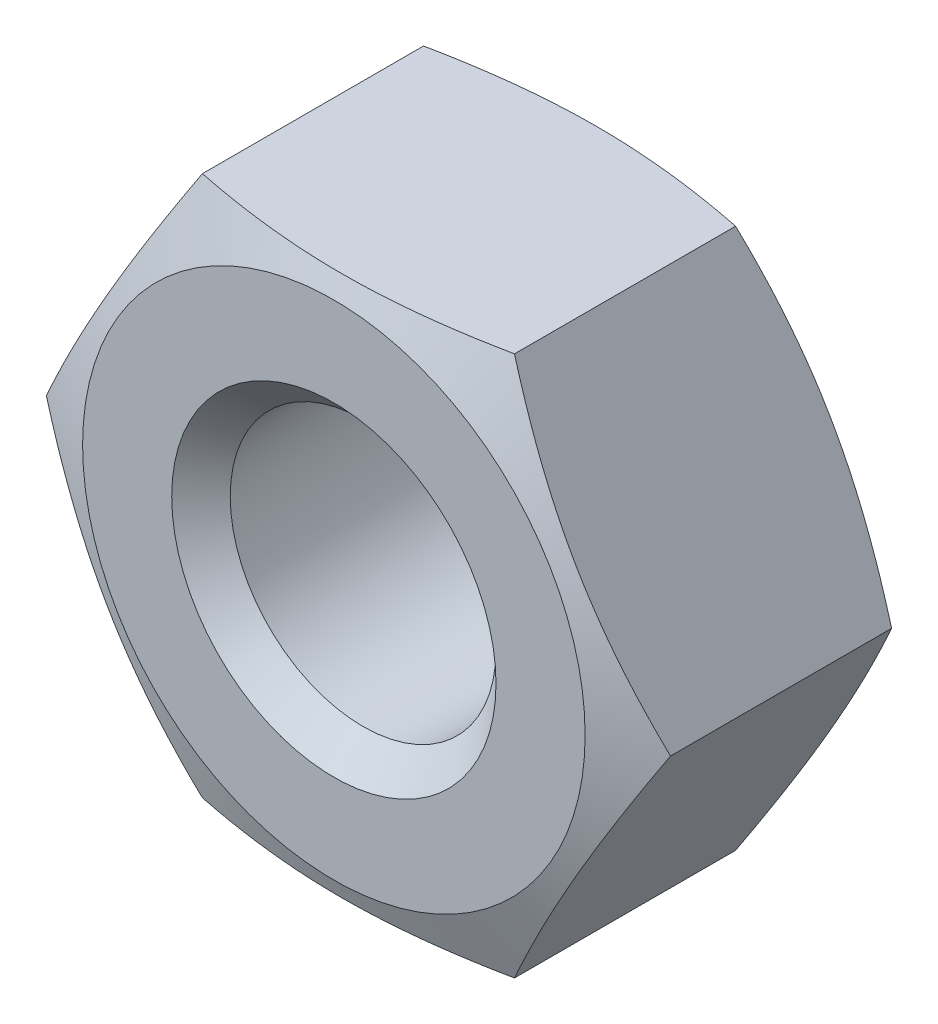
ISO-10303-21;
HEADER;
FILE_DESCRIPTION(('STEP AP214'),'2;1');
FILE_NAME('part.step','',(''),(''),'','','');
FILE_SCHEMA(('AUTOMOTIVE_DESIGN { 1 0 10303 214 1 1 1 1 }'));
ENDSEC;
DATA;
#1=APPLICATION_CONTEXT('core data for automotive mechanical design processes');
#2=APPLICATION_PROTOCOL_DEFINITION('international standard','automotive_design',2000,#1);
#3=PRODUCT_CONTEXT('',#1,'mechanical');
#4=PRODUCT('Part','Part','',(#3));
#5=PRODUCT_RELATED_PRODUCT_CATEGORY('part','',(#4));
#6=PRODUCT_DEFINITION_FORMATION('','',#4);
#7=PRODUCT_DEFINITION_CONTEXT('part definition',#1,'design');
#8=PRODUCT_DEFINITION('design','',#6,#7);
#9=PRODUCT_DEFINITION_SHAPE('','',#8);
#10=(LENGTH_UNIT() NAMED_UNIT(*) SI_UNIT(.MILLI.,.METRE.));
#11=(NAMED_UNIT(*) PLANE_ANGLE_UNIT() SI_UNIT($,.RADIAN.));
#12=(NAMED_UNIT(*) SI_UNIT($,.STERADIAN.) SOLID_ANGLE_UNIT());
#13=UNCERTAINTY_MEASURE_WITH_UNIT(LENGTH_MEASURE(1.E-05),#10,'distance_accuracy_value','');
#14=(GEOMETRIC_REPRESENTATION_CONTEXT(3) GLOBAL_UNCERTAINTY_ASSIGNED_CONTEXT((#13)) GLOBAL_UNIT_ASSIGNED_CONTEXT((#10,
#11,#12)) REPRESENTATION_CONTEXT('',''));
#15=CARTESIAN_POINT('',(0.,0.,0.));
#16=DIRECTION('',(0.,0.,1.));
#17=DIRECTION('',(1.,0.,0.));
#18=AXIS2_PLACEMENT_3D('',#15,#16,#17);
#19=CARTESIAN_POINT('',(-4.330125,-2.49999883437473,0.));
#20=DIRECTION('',(-0.866025403784439,-0.5,0.));
#21=DIRECTION('',(0.5,-0.866025403784439,0.));
#22=AXIS2_PLACEMENT_3D('',#19,#20,#21);
#23=PLANE('',#22);
#24=CARTESIAN_POINT('',(-5.7735,0.,4.54545454545455));
#25=CARTESIAN_POINT('',(-4.330125,-2.49999883437473,5.12861589916936));
#26=CARTESIAN_POINT('',(-2.88675,-4.99999766874946,4.54545454545455));
#27=(BOUNDED_CURVE() B_SPLINE_CURVE(2,(#24,#25,#26),.UNSPECIFIED.,.F.,
.F.) B_SPLINE_CURVE_WITH_KNOTS((3,3),(0.,5.80723387852188),
.UNSPECIFIED.) CURVE() GEOMETRIC_REPRESENTATION_ITEM() RATIONAL_B_SPLINE_CURVE((1.,
1.15470053837925,1.)) REPRESENTATION_ITEM(''));
#28=CARTESIAN_POINT('',(-5.7735,0.,4.54545454545455));
#29=VERTEX_POINT('',#28);
#30=CARTESIAN_POINT('',(-2.88675,-4.99999766874946,4.54545454545455));
#31=VERTEX_POINT('',#30);
#32=EDGE_CURVE('E107',#29,#31,#27,.T.);
#33=ORIENTED_EDGE('',*,*,#32,.F.);
#34=DIRECTION('',(0.,0.,1.));
#35=VECTOR('',#34,1.);
#36=CARTESIAN_POINT('',(-5.7735,0.,0.));
#37=LINE('',#36,#35);
#38=CARTESIAN_POINT('',(-5.7735,0.,0.454545454545455));
#39=VERTEX_POINT('',#38);
#40=EDGE_CURVE('E111',#39,#29,#37,.T.);
#41=ORIENTED_EDGE('',*,*,#40,.F.);
#42=CARTESIAN_POINT('',(-2.88675,-4.99999766874946,0.454545454545455));
#43=CARTESIAN_POINT('',(-4.330125,-2.49999883437473,-0.128615899169365));
#44=CARTESIAN_POINT('',(-5.7735,0.,0.454545454545455));
#45=(BOUNDED_CURVE() B_SPLINE_CURVE(2,(#42,#43,#44),.UNSPECIFIED.,.F.,
.F.) B_SPLINE_CURVE_WITH_KNOTS((3,3),(0.,5.80723387852187),
.UNSPECIFIED.) CURVE() GEOMETRIC_REPRESENTATION_ITEM() RATIONAL_B_SPLINE_CURVE((1.,
1.15470053837925,1.)) REPRESENTATION_ITEM(''));
#46=CARTESIAN_POINT('',(-2.88675,-4.99999766874946,0.454545454545455));
#47=VERTEX_POINT('',#46);
#48=EDGE_CURVE('E129',#47,#39,#45,.T.);
#49=ORIENTED_EDGE('',*,*,#48,.F.);
#50=DIRECTION('',(0.,0.,1.));
#51=VECTOR('',#50,1.);
#52=CARTESIAN_POINT('',(-2.88675,-4.99999766874946,0.));
#53=LINE('',#52,#51);
#54=EDGE_CURVE('E10',#47,#31,#53,.T.);
#55=ORIENTED_EDGE('',*,*,#54,.T.);
#56=EDGE_LOOP('',(#33,#41,#49,#55));
#57=FACE_BOUND('',#56,.T.);
#58=ADVANCED_FACE('F15',(#57),#23,.T.);
#59=CARTESIAN_POINT('',(0.,-4.99999766874946,0.));
#60=DIRECTION('',(0.,-1.,0.));
#61=DIRECTION('',(1.,0.,0.));
#62=AXIS2_PLACEMENT_3D('',#59,#60,#61);
#63=PLANE('',#62);
#64=CARTESIAN_POINT('',(-2.88675,-4.99999766874946,4.54545454545455));
#65=CARTESIAN_POINT('',(0.,-4.99999766874946,5.12861589916937));
#66=CARTESIAN_POINT('',(2.88675,-4.99999766874946,4.54545454545455));
#67=(BOUNDED_CURVE() B_SPLINE_CURVE(2,(#64,#65,#66),.UNSPECIFIED.,.F.,
.F.) B_SPLINE_CURVE_WITH_KNOTS((3,3),(0.,5.80723387852187),
.UNSPECIFIED.) CURVE() GEOMETRIC_REPRESENTATION_ITEM() RATIONAL_B_SPLINE_CURVE((1.,
1.15470053837925,1.)) REPRESENTATION_ITEM(''));
#68=CARTESIAN_POINT('',(2.88675,-4.99999766874946,4.54545454545455));
#69=VERTEX_POINT('',#68);
#70=EDGE_CURVE('E104',#31,#69,#67,.T.);
#71=ORIENTED_EDGE('',*,*,#70,.F.);
#72=ORIENTED_EDGE('',*,*,#54,.F.);
#73=CARTESIAN_POINT('',(2.88675,-4.99999766874946,0.454545454545455));
#74=CARTESIAN_POINT('',(0.,-4.99999766874946,-0.128615899169365));
#75=CARTESIAN_POINT('',(-2.88675,-4.99999766874946,0.454545454545455));
#76=(BOUNDED_CURVE() B_SPLINE_CURVE(2,(#73,#74,#75),.UNSPECIFIED.,.F.,
.F.) B_SPLINE_CURVE_WITH_KNOTS((3,3),(0.,5.80723387852187),
.UNSPECIFIED.) CURVE() GEOMETRIC_REPRESENTATION_ITEM() RATIONAL_B_SPLINE_CURVE((1.,
1.15470053837925,1.)) REPRESENTATION_ITEM(''));
#77=CARTESIAN_POINT('',(2.88675,-4.99999766874946,0.454545454545455));
#78=VERTEX_POINT('',#77);
#79=EDGE_CURVE('E147',#78,#47,#76,.T.);
#80=ORIENTED_EDGE('',*,*,#79,.F.);
#81=DIRECTION('',(0.,0.,1.));
#82=VECTOR('',#81,1.);
#83=CARTESIAN_POINT('',(2.88675,-4.99999766874946,0.));
#84=LINE('',#83,#82);
#85=EDGE_CURVE('E25',#78,#69,#84,.T.);
#86=ORIENTED_EDGE('',*,*,#85,.T.);
#87=EDGE_LOOP('',(#71,#72,#80,#86));
#88=FACE_BOUND('',#87,.T.);
#89=ADVANCED_FACE('F17',(#88),#63,.T.);
#90=CARTESIAN_POINT('',(0.,0.,0.));
#91=DIRECTION('',(0.,0.,1.));
#92=DIRECTION('',(1.,0.,0.));
#93=AXIS2_PLACEMENT_3D('',#90,#91,#92);
#94=PLANE('',#93);
#95=CARTESIAN_POINT('',(0.,0.,0.));
#96=DIRECTION('',(0.,0.,1.));
#97=DIRECTION('',(1.,0.,0.));
#98=AXIS2_PLACEMENT_3D('',#95,#96,#97);
#99=CIRCLE('',#98,4.64846052117441);
#100=CARTESIAN_POINT('',(4.64846052117441,0.,0.));
#101=VERTEX_POINT('',#100);
#102=EDGE_CURVE('E139',#101,#101,#99,.T.);
#103=ORIENTED_EDGE('',*,*,#102,.F.);
#104=EDGE_LOOP('',(#103));
#105=FACE_BOUND('',#104,.T.);
#106=CARTESIAN_POINT('',(0.,0.,0.));
#107=DIRECTION('',(0.,0.,-1.));
#108=DIRECTION('',(1.,0.,0.));
#109=AXIS2_PLACEMENT_3D('',#106,#107,#108);
#110=CIRCLE('',#109,3.);
#111=CARTESIAN_POINT('',(3.,0.,0.));
#112=VERTEX_POINT('',#111);
#113=EDGE_CURVE('E32',#112,#112,#110,.T.);
#114=ORIENTED_EDGE('',*,*,#113,.F.);
#115=EDGE_LOOP('',(#114));
#116=FACE_BOUND('',#115,.T.);
#117=ADVANCED_FACE('F235',(#105,#116),#94,.F.);
#118=CARTESIAN_POINT('',(0.,0.,5.));
#119=DIRECTION('',(0.,0.,1.));
#120=DIRECTION('',(1.,0.,0.));
#121=AXIS2_PLACEMENT_3D('',#118,#119,#120);
#122=PLANE('',#121);
#123=CARTESIAN_POINT('',(0.,0.,5.));
#124=DIRECTION('',(0.,0.,-1.));
#125=DIRECTION('',(1.,0.,0.));
#126=AXIS2_PLACEMENT_3D('',#123,#124,#125);
#127=CIRCLE('',#126,4.64846052117441);
#128=CARTESIAN_POINT('',(4.64846052117441,0.,5.));
#129=VERTEX_POINT('',#128);
#130=EDGE_CURVE('E19',#129,#129,#127,.T.);
#131=ORIENTED_EDGE('',*,*,#130,.F.);
#132=EDGE_LOOP('',(#131));
#133=FACE_BOUND('',#132,.T.);
#134=CARTESIAN_POINT('',(0.,0.,5.));
#135=DIRECTION('',(0.,0.,1.));
#136=DIRECTION('',(1.,0.,0.));
#137=AXIS2_PLACEMENT_3D('',#134,#135,#136);
#138=CIRCLE('',#137,3.);
#139=CARTESIAN_POINT('',(3.,0.,5.));
#140=VERTEX_POINT('',#139);
#141=EDGE_CURVE('E93',#140,#140,#138,.T.);
#142=ORIENTED_EDGE('',*,*,#141,.F.);
#143=EDGE_LOOP('',(#142));
#144=FACE_BOUND('',#143,.T.);
#145=ADVANCED_FACE('F226',(#133,#144),#122,.T.);
#146=CARTESIAN_POINT('',(4.330125,-2.49999883437473,0.));
#147=DIRECTION('',(0.866025403784439,-0.5,0.));
#148=DIRECTION('',(0.5,0.866025403784439,0.));
#149=AXIS2_PLACEMENT_3D('',#146,#147,#148);
#150=PLANE('',#149);
#151=CARTESIAN_POINT('',(2.88675,-4.99999766874946,4.54545454545455));
#152=CARTESIAN_POINT('',(4.330125,-2.49999883437473,5.12861589916936));
#153=CARTESIAN_POINT('',(5.7735,0.,4.54545454545455));
#154=(BOUNDED_CURVE() B_SPLINE_CURVE(2,(#151,#152,#153),.UNSPECIFIED.,.F.,
.F.) B_SPLINE_CURVE_WITH_KNOTS((3,3),(0.,5.80723387852188),
.UNSPECIFIED.) CURVE() GEOMETRIC_REPRESENTATION_ITEM() RATIONAL_B_SPLINE_CURVE((1.,
1.15470053837925,1.)) REPRESENTATION_ITEM(''));
#155=CARTESIAN_POINT('',(5.7735,0.,4.54545454545455));
#156=VERTEX_POINT('',#155);
#157=EDGE_CURVE('E130',#69,#156,#154,.T.);
#158=ORIENTED_EDGE('',*,*,#157,.F.);
#159=ORIENTED_EDGE('',*,*,#85,.F.);
#160=CARTESIAN_POINT('',(5.7735,0.,0.454545454545455));
#161=CARTESIAN_POINT('',(4.330125,-2.49999883437473,-0.128615899169365));
#162=CARTESIAN_POINT('',(2.88675,-4.99999766874946,0.454545454545455));
#163=(BOUNDED_CURVE() B_SPLINE_CURVE(2,(#160,#161,#162),.UNSPECIFIED.,.F.,
.F.) B_SPLINE_CURVE_WITH_KNOTS((3,3),(0.,5.80723387852187),
.UNSPECIFIED.) CURVE() GEOMETRIC_REPRESENTATION_ITEM() RATIONAL_B_SPLINE_CURVE((1.,
1.15470053837925,1.)) REPRESENTATION_ITEM(''));
#164=CARTESIAN_POINT('',(5.7735,0.,0.454545454545455));
#165=VERTEX_POINT('',#164);
#166=EDGE_CURVE('E182',#165,#78,#163,.T.);
#167=ORIENTED_EDGE('',*,*,#166,.F.);
#168=DIRECTION('',(0.,0.,1.));
#169=VECTOR('',#168,1.);
#170=CARTESIAN_POINT('',(5.7735,0.,0.));
#171=LINE('',#170,#169);
#172=EDGE_CURVE('E166',#165,#156,#171,.T.);
#173=ORIENTED_EDGE('',*,*,#172,.T.);
#174=EDGE_LOOP('',(#158,#159,#167,#173));
#175=FACE_BOUND('',#174,.T.);
#176=ADVANCED_FACE('F216',(#175),#150,.T.);
#177=CARTESIAN_POINT('',(4.330125,2.49999883437473,0.));
#178=DIRECTION('',(0.866025403784439,0.5,0.));
#179=DIRECTION('',(-0.5,0.866025403784439,0.));
#180=AXIS2_PLACEMENT_3D('',#177,#178,#179);
#181=PLANE('',#180);
#182=CARTESIAN_POINT('',(5.7735,0.,4.54545454545455));
#183=CARTESIAN_POINT('',(4.330125,2.49999883437472,5.12861589916937));
#184=CARTESIAN_POINT('',(2.88675,4.99999766874946,4.54545454545455));
#185=(BOUNDED_CURVE() B_SPLINE_CURVE(2,(#182,#183,#184),.UNSPECIFIED.,.F.,
.F.) B_SPLINE_CURVE_WITH_KNOTS((3,3),(0.,5.80723387852187),
.UNSPECIFIED.) CURVE() GEOMETRIC_REPRESENTATION_ITEM() RATIONAL_B_SPLINE_CURVE((1.,
1.15470053837926,1.)) REPRESENTATION_ITEM(''));
#186=CARTESIAN_POINT('',(2.88675,4.99999766874946,4.54545454545455));
#187=VERTEX_POINT('',#186);
#188=EDGE_CURVE('E138',#156,#187,#185,.T.);
#189=ORIENTED_EDGE('',*,*,#188,.F.);
#190=ORIENTED_EDGE('',*,*,#172,.F.);
#191=CARTESIAN_POINT('',(2.88675,4.99999766874946,0.454545454545455));
#192=CARTESIAN_POINT('',(4.330125,2.49999883437474,-0.128615899169366));
#193=CARTESIAN_POINT('',(5.7735,0.,0.454545454545455));
#194=(BOUNDED_CURVE() B_SPLINE_CURVE(2,(#191,#192,#193),.UNSPECIFIED.,.F.,
.F.) B_SPLINE_CURVE_WITH_KNOTS((3,3),(0.,5.80723387852188),
.UNSPECIFIED.) CURVE() GEOMETRIC_REPRESENTATION_ITEM() RATIONAL_B_SPLINE_CURVE((1.,
1.15470053837925,1.)) REPRESENTATION_ITEM(''));
#195=CARTESIAN_POINT('',(2.88675,4.99999766874946,0.454545454545454));
#196=VERTEX_POINT('',#195);
#197=EDGE_CURVE('E169',#196,#165,#194,.T.);
#198=ORIENTED_EDGE('',*,*,#197,.F.);
#199=DIRECTION('',(0.,0.,1.));
#200=VECTOR('',#199,1.);
#201=CARTESIAN_POINT('',(2.88675,4.99999766874946,0.));
#202=LINE('',#201,#200);
#203=EDGE_CURVE('E80',#196,#187,#202,.T.);
#204=ORIENTED_EDGE('',*,*,#203,.T.);
#205=EDGE_LOOP('',(#189,#190,#198,#204));
#206=FACE_BOUND('',#205,.T.);
#207=ADVANCED_FACE('F217',(#206),#181,.T.);
#208=CARTESIAN_POINT('',(0.,4.99999766874946,0.));
#209=DIRECTION('',(0.,1.,0.));
#210=DIRECTION('',(-1.,0.,0.));
#211=AXIS2_PLACEMENT_3D('',#208,#209,#210);
#212=PLANE('',#211);
#213=CARTESIAN_POINT('',(2.88675,4.99999766874946,4.54545454545455));
#214=CARTESIAN_POINT('',(0.,4.99999766874944,5.12861589916937));
#215=CARTESIAN_POINT('',(-2.88675,4.99999766874946,4.54545454545455));
#216=(BOUNDED_CURVE() B_SPLINE_CURVE(2,(#213,#214,#215),.UNSPECIFIED.,.F.,
.F.) B_SPLINE_CURVE_WITH_KNOTS((3,3),(0.,5.80723387852188),
.UNSPECIFIED.) CURVE() GEOMETRIC_REPRESENTATION_ITEM() RATIONAL_B_SPLINE_CURVE((1.,
1.15470053837926,1.)) REPRESENTATION_ITEM(''));
#217=CARTESIAN_POINT('',(-2.88675,4.99999766874946,4.54545454545455));
#218=VERTEX_POINT('',#217);
#219=EDGE_CURVE('E119',#187,#218,#216,.T.);
#220=ORIENTED_EDGE('',*,*,#219,.F.);
#221=ORIENTED_EDGE('',*,*,#203,.F.);
#222=CARTESIAN_POINT('',(-2.88675,4.99999766874946,0.454545454545455));
#223=CARTESIAN_POINT('',(0.,4.99999766874946,-0.128615899169367));
#224=CARTESIAN_POINT('',(2.88675,4.99999766874946,0.454545454545455));
#225=(BOUNDED_CURVE() B_SPLINE_CURVE(2,(#222,#223,#224),.UNSPECIFIED.,.F.,
.F.) B_SPLINE_CURVE_WITH_KNOTS((3,3),(0.,5.80723387852188),
.UNSPECIFIED.) CURVE() GEOMETRIC_REPRESENTATION_ITEM() RATIONAL_B_SPLINE_CURVE((1.,
1.15470053837925,1.)) REPRESENTATION_ITEM(''));
#226=CARTESIAN_POINT('',(-2.88675,4.99999766874946,0.454545454545454));
#227=VERTEX_POINT('',#226);
#228=EDGE_CURVE('E128',#227,#196,#225,.T.);
#229=ORIENTED_EDGE('',*,*,#228,.F.);
#230=DIRECTION('',(0.,0.,1.));
#231=VECTOR('',#230,1.);
#232=CARTESIAN_POINT('',(-2.88675,4.99999766874946,0.));
#233=LINE('',#232,#231);
#234=EDGE_CURVE('E72',#227,#218,#233,.T.);
#235=ORIENTED_EDGE('',*,*,#234,.T.);
#236=EDGE_LOOP('',(#220,#221,#229,#235));
#237=FACE_BOUND('',#236,.T.);
#238=ADVANCED_FACE('F209',(#237),#212,.T.);
#239=CARTESIAN_POINT('',(-4.330125,2.49999883437473,0.));
#240=DIRECTION('',(-0.866025403784439,0.5,0.));
#241=DIRECTION('',(-0.5,-0.866025403784439,0.));
#242=AXIS2_PLACEMENT_3D('',#239,#240,#241);
#243=PLANE('',#242);
#244=CARTESIAN_POINT('',(-2.88675,4.99999766874946,4.54545454545455));
#245=CARTESIAN_POINT('',(-4.330125,2.49999883437473,5.12861589916937));
#246=CARTESIAN_POINT('',(-5.7735,0.,4.54545454545455));
#247=(BOUNDED_CURVE() B_SPLINE_CURVE(2,(#244,#245,#246),.UNSPECIFIED.,.F.,
.F.) B_SPLINE_CURVE_WITH_KNOTS((3,3),(0.,5.80723387852188),
.UNSPECIFIED.) CURVE() GEOMETRIC_REPRESENTATION_ITEM() RATIONAL_B_SPLINE_CURVE((1.,
1.15470053837925,1.)) REPRESENTATION_ITEM(''));
#248=EDGE_CURVE('E114',#218,#29,#247,.T.);
#249=ORIENTED_EDGE('',*,*,#248,.F.);
#250=ORIENTED_EDGE('',*,*,#234,.F.);
#251=CARTESIAN_POINT('',(-5.7735,0.,0.454545454545455));
#252=CARTESIAN_POINT('',(-4.330125,2.49999883437473,-0.128615899169366));
#253=CARTESIAN_POINT('',(-2.88675,4.99999766874946,0.454545454545455));
#254=(BOUNDED_CURVE() B_SPLINE_CURVE(2,(#251,#252,#253),.UNSPECIFIED.,.F.,
.F.) B_SPLINE_CURVE_WITH_KNOTS((3,3),(0.,5.80723387852188),
.UNSPECIFIED.) CURVE() GEOMETRIC_REPRESENTATION_ITEM() RATIONAL_B_SPLINE_CURVE((1.,
1.15470053837925,1.)) REPRESENTATION_ITEM(''));
#255=EDGE_CURVE('E120',#39,#227,#254,.T.);
#256=ORIENTED_EDGE('',*,*,#255,.F.);
#257=ORIENTED_EDGE('',*,*,#40,.T.);
#258=EDGE_LOOP('',(#249,#250,#256,#257));
#259=FACE_BOUND('',#258,.T.);
#260=ADVANCED_FACE('F215',(#259),#243,.T.);
#261=CARTESIAN_POINT('',(0.,0.,0.270625));
#262=DIRECTION('',(0.,0.,-1.));
#263=DIRECTION('',(1.,0.,0.));
#264=AXIS2_PLACEMENT_3D('',#261,#262,#263);
#265=CONICAL_SURFACE('',#264,2.729375,0.785398163397448);
#266=CARTESIAN_POINT('',(0.,0.,0.54125));
#267=DIRECTION('',(0.,0.,1.));
#268=DIRECTION('',(1.,0.,0.));
#269=AXIS2_PLACEMENT_3D('',#266,#267,#268);
#270=CIRCLE('',#269,2.45875);
#271=CARTESIAN_POINT('',(2.45875,0.,0.54125));
#272=VERTEX_POINT('',#271);
#273=EDGE_CURVE('E102',#272,#272,#270,.T.);
#274=ORIENTED_EDGE('',*,*,#273,.T.);
#275=EDGE_LOOP('',(#274));
#276=FACE_BOUND('',#275,.T.);
#277=ORIENTED_EDGE('',*,*,#113,.T.);
#278=EDGE_LOOP('',(#277));
#279=FACE_BOUND('',#278,.T.);
#280=ADVANCED_FACE('F240',(#276,#279),#265,.F.);
#281=CARTESIAN_POINT('',(0.,0.,2.5));
#282=DIRECTION('',(0.,0.,-1.));
#283=DIRECTION('',(1.,0.,0.));
#284=AXIS2_PLACEMENT_3D('',#281,#282,#283);
#285=CYLINDRICAL_SURFACE('',#284,2.45875);
#286=CARTESIAN_POINT('',(0.,0.,4.45875));
#287=DIRECTION('',(0.,0.,1.));
#288=DIRECTION('',(1.,0.,0.));
#289=AXIS2_PLACEMENT_3D('',#286,#287,#288);
#290=CIRCLE('',#289,2.45875);
#291=CARTESIAN_POINT('',(2.45875,0.,4.45875));
#292=VERTEX_POINT('',#291);
#293=EDGE_CURVE('E97',#292,#292,#290,.T.);
#294=ORIENTED_EDGE('',*,*,#293,.T.);
#295=EDGE_LOOP('',(#294));
#296=FACE_BOUND('',#295,.T.);
#297=ORIENTED_EDGE('',*,*,#273,.F.);
#298=EDGE_LOOP('',(#297));
#299=FACE_BOUND('',#298,.T.);
#300=ADVANCED_FACE('F98',(#296,#299),#285,.F.);
#301=CARTESIAN_POINT('',(0.,0.,4.729375));
#302=DIRECTION('',(0.,0.,1.));
#303=DIRECTION('',(1.,0.,0.));
#304=AXIS2_PLACEMENT_3D('',#301,#302,#303);
#305=CONICAL_SURFACE('',#304,2.729375,0.785398163397448);
#306=ORIENTED_EDGE('',*,*,#141,.T.);
#307=EDGE_LOOP('',(#306));
#308=FACE_BOUND('',#307,.T.);
#309=ORIENTED_EDGE('',*,*,#293,.F.);
#310=EDGE_LOOP('',(#309));
#311=FACE_BOUND('',#310,.T.);
#312=ADVANCED_FACE('F239',(#308,#311),#305,.F.);
#313=CARTESIAN_POINT('',(0.,0.,4.77272727272727));
#314=DIRECTION('',(0.,0.,-1.));
#315=DIRECTION('',(1.,0.,0.));
#316=AXIS2_PLACEMENT_3D('',#313,#314,#315);
#317=CONICAL_SURFACE('',#316,5.21098026058721,1.18682389135614);
#318=ORIENTED_EDGE('',*,*,#130,.T.);
#319=EDGE_LOOP('',(#318));
#320=FACE_BOUND('',#319,.T.);
#321=ORIENTED_EDGE('',*,*,#157,.T.);
#322=ORIENTED_EDGE('',*,*,#188,.T.);
#323=ORIENTED_EDGE('',*,*,#219,.T.);
#324=ORIENTED_EDGE('',*,*,#248,.T.);
#325=ORIENTED_EDGE('',*,*,#32,.T.);
#326=ORIENTED_EDGE('',*,*,#70,.T.);
#327=EDGE_LOOP('',(#321,#322,#323,#324,#325,#326));
#328=FACE_BOUND('',#327,.T.);
#329=ADVANCED_FACE('F206',(#320,#328),#317,.T.);
#330=CARTESIAN_POINT('',(0.,0.,0.227272727272728));
#331=DIRECTION('',(0.,0.,1.));
#332=DIRECTION('',(1.,0.,0.));
#333=AXIS2_PLACEMENT_3D('',#330,#331,#332);
#334=CONICAL_SURFACE('',#333,5.21098026058721,1.18682389135614);
#335=ORIENTED_EDGE('',*,*,#102,.T.);
#336=EDGE_LOOP('',(#335));
#337=FACE_BOUND('',#336,.T.);
#338=ORIENTED_EDGE('',*,*,#166,.T.);
#339=ORIENTED_EDGE('',*,*,#79,.T.);
#340=ORIENTED_EDGE('',*,*,#48,.T.);
#341=ORIENTED_EDGE('',*,*,#255,.T.);
#342=ORIENTED_EDGE('',*,*,#228,.T.);
#343=ORIENTED_EDGE('',*,*,#197,.T.);
#344=EDGE_LOOP('',(#338,#339,#340,#341,#342,#343));
#345=FACE_BOUND('',#344,.T.);
#346=ADVANCED_FACE('F248',(#337,#345),#334,.T.);
#347=CLOSED_SHELL('',(#58,#89,#117,#145,#176,#207,#238,#260,#280,#300,#312,#329,#346));
#348=MANIFOLD_SOLID_BREP('B1',#347);
#349=ADVANCED_BREP_SHAPE_REPRESENTATION('',(#18,#348),#14);
#350=SHAPE_DEFINITION_REPRESENTATION(#9,#349);
ENDSEC;
END-ISO-10303-21;
